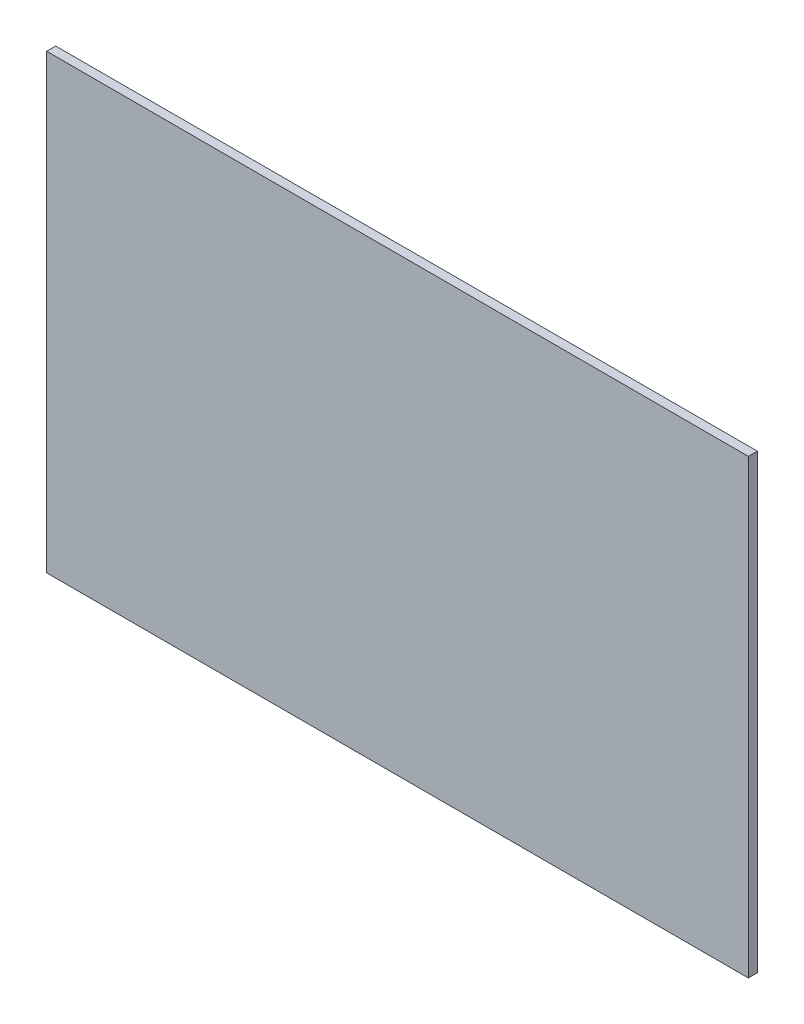
ISO-10303-21;
HEADER;
FILE_DESCRIPTION(('STEP AP214'),'2;1');
FILE_NAME('part.step','',(''),(''),'','','');
FILE_SCHEMA(('AUTOMOTIVE_DESIGN { 1 0 10303 214 1 1 1 1 }'));
ENDSEC;
DATA;
#1=APPLICATION_CONTEXT('core data for automotive mechanical design processes');
#2=APPLICATION_PROTOCOL_DEFINITION('international standard','automotive_design',2000,#1);
#3=PRODUCT_CONTEXT('',#1,'mechanical');
#4=PRODUCT('Part','Part','',(#3));
#5=PRODUCT_RELATED_PRODUCT_CATEGORY('part','',(#4));
#6=PRODUCT_DEFINITION_FORMATION('','',#4);
#7=PRODUCT_DEFINITION_CONTEXT('part definition',#1,'design');
#8=PRODUCT_DEFINITION('design','',#6,#7);
#9=PRODUCT_DEFINITION_SHAPE('','',#8);
#10=(LENGTH_UNIT() NAMED_UNIT(*) SI_UNIT(.MILLI.,.METRE.));
#11=(NAMED_UNIT(*) PLANE_ANGLE_UNIT() SI_UNIT($,.RADIAN.));
#12=(NAMED_UNIT(*) SI_UNIT($,.STERADIAN.) SOLID_ANGLE_UNIT());
#13=UNCERTAINTY_MEASURE_WITH_UNIT(LENGTH_MEASURE(1.E-05),#10,'distance_accuracy_value','');
#14=(GEOMETRIC_REPRESENTATION_CONTEXT(3) GLOBAL_UNCERTAINTY_ASSIGNED_CONTEXT((#13)) GLOBAL_UNIT_ASSIGNED_CONTEXT((#10,
#11,#12)) REPRESENTATION_CONTEXT('',''));
#15=CARTESIAN_POINT('',(0.,0.,0.));
#16=DIRECTION('',(0.,0.,1.));
#17=DIRECTION('',(1.,0.,0.));
#18=AXIS2_PLACEMENT_3D('',#15,#16,#17);
#19=CARTESIAN_POINT('',(116.5,0.,3.));
#20=DIRECTION('',(1.,0.,0.));
#21=DIRECTION('',(0.,1.,0.));
#22=AXIS2_PLACEMENT_3D('',#19,#20,#21);
#23=PLANE('',#22);
#24=DIRECTION('',(0.,-1.,0.));
#25=VECTOR('',#24,1.);
#26=CARTESIAN_POINT('',(116.5,0.,0.));
#27=LINE('',#26,#25);
#28=CARTESIAN_POINT('',(116.5,104.,0.));
#29=VERTEX_POINT('',#28);
#30=CARTESIAN_POINT('',(116.5,-46.,0.));
#31=VERTEX_POINT('',#30);
#32=EDGE_CURVE('E98',#29,#31,#27,.T.);
#33=ORIENTED_EDGE('',*,*,#32,.F.);
#34=DIRECTION('',(0.,0.,-1.));
#35=VECTOR('',#34,1.);
#36=CARTESIAN_POINT('',(116.5,104.,3.));
#37=LINE('',#36,#35);
#38=CARTESIAN_POINT('',(116.5,104.,3.));
#39=VERTEX_POINT('',#38);
#40=EDGE_CURVE('E11',#39,#29,#37,.T.);
#41=ORIENTED_EDGE('',*,*,#40,.F.);
#42=DIRECTION('',(0.,-1.,0.));
#43=VECTOR('',#42,1.);
#44=CARTESIAN_POINT('',(116.5,0.,3.));
#45=LINE('',#44,#43);
#46=CARTESIAN_POINT('',(116.5,-46.,3.));
#47=VERTEX_POINT('',#46);
#48=EDGE_CURVE('E92',#39,#47,#45,.T.);
#49=ORIENTED_EDGE('',*,*,#48,.T.);
#50=DIRECTION('',(0.,0.,-1.));
#51=VECTOR('',#50,1.);
#52=CARTESIAN_POINT('',(116.5,-46.,3.));
#53=LINE('',#52,#51);
#54=EDGE_CURVE('E73',#47,#31,#53,.T.);
#55=ORIENTED_EDGE('',*,*,#54,.T.);
#56=EDGE_LOOP('',(#33,#41,#49,#55));
#57=FACE_BOUND('',#56,.T.);
#58=ADVANCED_FACE('F35',(#57),#23,.T.);
#59=CARTESIAN_POINT('',(0.,104.,3.));
#60=DIRECTION('',(0.,1.,0.));
#61=DIRECTION('',(0.,0.,1.));
#62=AXIS2_PLACEMENT_3D('',#59,#60,#61);
#63=PLANE('',#62);
#64=DIRECTION('',(1.,0.,0.));
#65=VECTOR('',#64,1.);
#66=CARTESIAN_POINT('',(0.,104.,0.));
#67=LINE('',#66,#65);
#68=CARTESIAN_POINT('',(-116.5,104.,0.));
#69=VERTEX_POINT('',#68);
#70=EDGE_CURVE('E86',#69,#29,#67,.T.);
#71=ORIENTED_EDGE('',*,*,#70,.F.);
#72=DIRECTION('',(0.,0.,-1.));
#73=VECTOR('',#72,1.);
#74=CARTESIAN_POINT('',(-116.5,104.,3.));
#75=LINE('',#74,#73);
#76=CARTESIAN_POINT('',(-116.5,104.,3.));
#77=VERTEX_POINT('',#76);
#78=EDGE_CURVE('E43',#77,#69,#75,.T.);
#79=ORIENTED_EDGE('',*,*,#78,.F.);
#80=DIRECTION('',(1.,0.,0.));
#81=VECTOR('',#80,1.);
#82=CARTESIAN_POINT('',(0.,104.,3.));
#83=LINE('',#82,#81);
#84=EDGE_CURVE('E84',#77,#39,#83,.T.);
#85=ORIENTED_EDGE('',*,*,#84,.T.);
#86=ORIENTED_EDGE('',*,*,#40,.T.);
#87=EDGE_LOOP('',(#71,#79,#85,#86));
#88=FACE_BOUND('',#87,.T.);
#89=ADVANCED_FACE('F82',(#88),#63,.T.);
#90=CARTESIAN_POINT('',(-116.5,0.,3.));
#91=DIRECTION('',(1.,0.,0.));
#92=DIRECTION('',(0.,1.,0.));
#93=AXIS2_PLACEMENT_3D('',#90,#91,#92);
#94=PLANE('',#93);
#95=DIRECTION('',(0.,-1.,0.));
#96=VECTOR('',#95,1.);
#97=CARTESIAN_POINT('',(-116.5,0.,0.));
#98=LINE('',#97,#96);
#99=CARTESIAN_POINT('',(-116.5,-46.,0.));
#100=VERTEX_POINT('',#99);
#101=EDGE_CURVE('E66',#69,#100,#98,.T.);
#102=ORIENTED_EDGE('',*,*,#101,.T.);
#103=DIRECTION('',(0.,0.,-1.));
#104=VECTOR('',#103,1.);
#105=CARTESIAN_POINT('',(-116.5,-46.,3.));
#106=LINE('',#105,#104);
#107=CARTESIAN_POINT('',(-116.5,-46.,3.));
#108=VERTEX_POINT('',#107);
#109=EDGE_CURVE('E87',#108,#100,#106,.T.);
#110=ORIENTED_EDGE('',*,*,#109,.F.);
#111=DIRECTION('',(0.,-1.,0.));
#112=VECTOR('',#111,1.);
#113=CARTESIAN_POINT('',(-116.5,0.,3.));
#114=LINE('',#113,#112);
#115=EDGE_CURVE('E88',#77,#108,#114,.T.);
#116=ORIENTED_EDGE('',*,*,#115,.F.);
#117=ORIENTED_EDGE('',*,*,#78,.T.);
#118=EDGE_LOOP('',(#102,#110,#116,#117));
#119=FACE_BOUND('',#118,.T.);
#120=ADVANCED_FACE('F89',(#119),#94,.F.);
#121=CARTESIAN_POINT('',(0.,-46.,3.));
#122=DIRECTION('',(0.,1.,0.));
#123=DIRECTION('',(-1.,0.,0.));
#124=AXIS2_PLACEMENT_3D('',#121,#122,#123);
#125=PLANE('',#124);
#126=DIRECTION('',(1.,0.,0.));
#127=VECTOR('',#126,1.);
#128=CARTESIAN_POINT('',(0.,-46.,0.));
#129=LINE('',#128,#127);
#130=EDGE_CURVE('E94',#100,#31,#129,.T.);
#131=ORIENTED_EDGE('',*,*,#130,.T.);
#132=ORIENTED_EDGE('',*,*,#54,.F.);
#133=DIRECTION('',(1.,0.,0.));
#134=VECTOR('',#133,1.);
#135=CARTESIAN_POINT('',(0.,-46.,3.));
#136=LINE('',#135,#134);
#137=EDGE_CURVE('E51',#108,#47,#136,.T.);
#138=ORIENTED_EDGE('',*,*,#137,.F.);
#139=ORIENTED_EDGE('',*,*,#109,.T.);
#140=EDGE_LOOP('',(#131,#132,#138,#139));
#141=FACE_BOUND('',#140,.T.);
#142=ADVANCED_FACE('F107',(#141),#125,.F.);
#143=CARTESIAN_POINT('',(0.,0.,3.));
#144=DIRECTION('',(0.,0.,1.));
#145=DIRECTION('',(1.,0.,0.));
#146=AXIS2_PLACEMENT_3D('',#143,#144,#145);
#147=PLANE('',#146);
#148=ORIENTED_EDGE('',*,*,#48,.F.);
#149=ORIENTED_EDGE('',*,*,#84,.F.);
#150=ORIENTED_EDGE('',*,*,#115,.T.);
#151=ORIENTED_EDGE('',*,*,#137,.T.);
#152=EDGE_LOOP('',(#148,#149,#150,#151));
#153=FACE_BOUND('',#152,.T.);
#154=ADVANCED_FACE('F91',(#153),#147,.T.);
#155=CARTESIAN_POINT('',(0.,0.,0.));
#156=DIRECTION('',(0.,0.,1.));
#157=DIRECTION('',(1.,0.,0.));
#158=AXIS2_PLACEMENT_3D('',#155,#156,#157);
#159=PLANE('',#158);
#160=ORIENTED_EDGE('',*,*,#32,.T.);
#161=ORIENTED_EDGE('',*,*,#130,.F.);
#162=ORIENTED_EDGE('',*,*,#101,.F.);
#163=ORIENTED_EDGE('',*,*,#70,.T.);
#164=EDGE_LOOP('',(#160,#161,#162,#163));
#165=FACE_BOUND('',#164,.T.);
#166=ADVANCED_FACE('F109',(#165),#159,.F.);
#167=CLOSED_SHELL('',(#58,#89,#120,#142,#154,#166));
#168=MANIFOLD_SOLID_BREP('B2',#167);
#169=ADVANCED_BREP_SHAPE_REPRESENTATION('',(#18,#168),#14);
#170=SHAPE_DEFINITION_REPRESENTATION(#9,#169);
ENDSEC;
END-ISO-10303-21;
